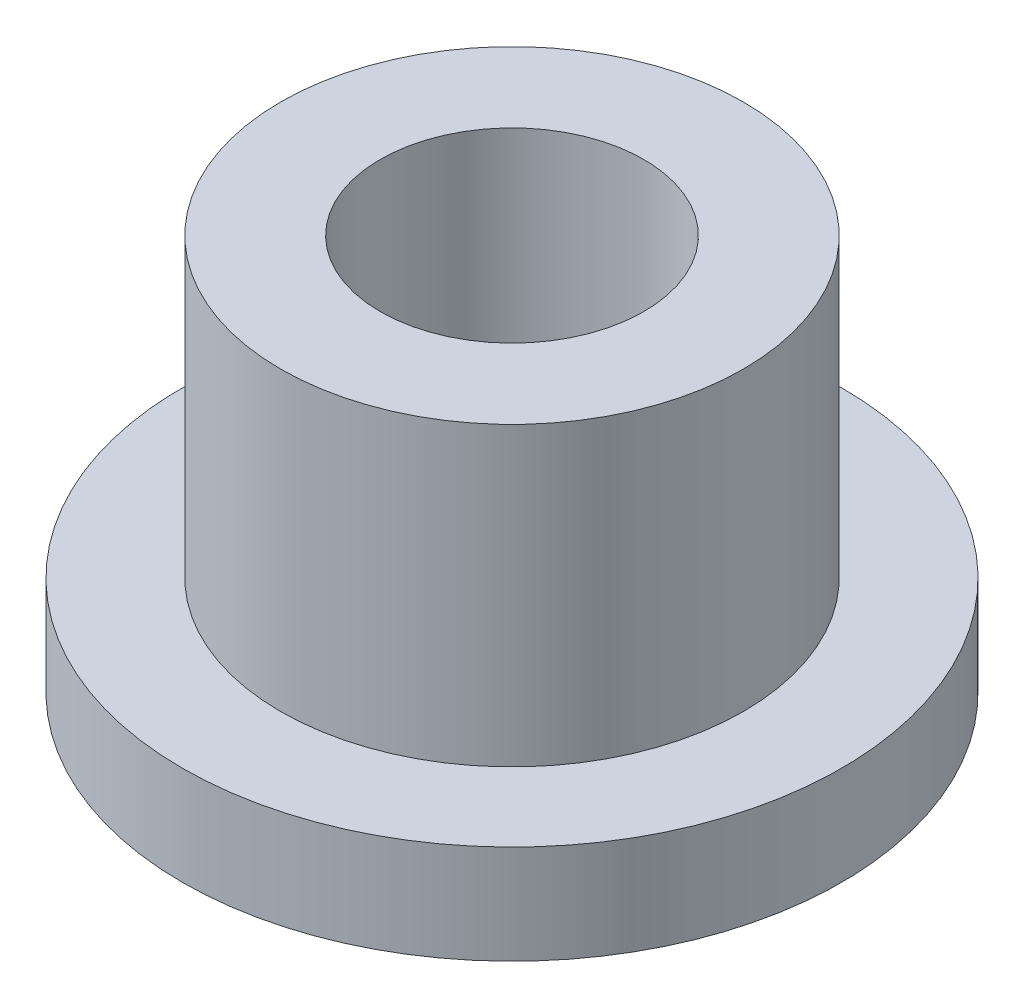
ISO-10303-21;
HEADER;
FILE_DESCRIPTION(('STEP AP214'),'2;1');
FILE_NAME('part.step','',(''),(''),'','','');
FILE_SCHEMA(('AUTOMOTIVE_DESIGN { 1 0 10303 214 1 1 1 1 }'));
ENDSEC;
DATA;
#1=APPLICATION_CONTEXT('core data for automotive mechanical design processes');
#2=APPLICATION_PROTOCOL_DEFINITION('international standard','automotive_design',2000,#1);
#3=PRODUCT_CONTEXT('',#1,'mechanical');
#4=PRODUCT('Part','Part','',(#3));
#5=PRODUCT_RELATED_PRODUCT_CATEGORY('part','',(#4));
#6=PRODUCT_DEFINITION_FORMATION('','',#4);
#7=PRODUCT_DEFINITION_CONTEXT('part definition',#1,'design');
#8=PRODUCT_DEFINITION('design','',#6,#7);
#9=PRODUCT_DEFINITION_SHAPE('','',#8);
#10=(LENGTH_UNIT() NAMED_UNIT(*) SI_UNIT(.MILLI.,.METRE.));
#11=(NAMED_UNIT(*) PLANE_ANGLE_UNIT() SI_UNIT($,.RADIAN.));
#12=(NAMED_UNIT(*) SI_UNIT($,.STERADIAN.) SOLID_ANGLE_UNIT());
#13=UNCERTAINTY_MEASURE_WITH_UNIT(LENGTH_MEASURE(1.E-05),#10,'distance_accuracy_value','');
#14=(GEOMETRIC_REPRESENTATION_CONTEXT(3) GLOBAL_UNCERTAINTY_ASSIGNED_CONTEXT((#13)) GLOBAL_UNIT_ASSIGNED_CONTEXT((#10,
#11,#12)) REPRESENTATION_CONTEXT('',''));
#15=CARTESIAN_POINT('',(0.,0.,0.));
#16=DIRECTION('',(0.,0.,1.));
#17=DIRECTION('',(1.,0.,0.));
#18=AXIS2_PLACEMENT_3D('',#15,#16,#17);
#19=CARTESIAN_POINT('',(0.,6.,0.));
#20=DIRECTION('',(0.,1.,0.));
#21=DIRECTION('',(0.,0.,1.));
#22=AXIS2_PLACEMENT_3D('',#19,#20,#21);
#23=PLANE('',#22);
#24=CARTESIAN_POINT('',(0.,6.,0.));
#25=DIRECTION('',(0.,1.,0.));
#26=DIRECTION('',(0.,0.,1.));
#27=AXIS2_PLACEMENT_3D('',#24,#25,#26);
#28=CIRCLE('',#27,3.51);
#29=CARTESIAN_POINT('',(0.,6.,3.51));
#30=VERTEX_POINT('',#29);
#31=EDGE_CURVE('E10',#30,#30,#28,.T.);
#32=ORIENTED_EDGE('',*,*,#31,.T.);
#33=EDGE_LOOP('',(#32));
#34=FACE_BOUND('',#33,.T.);
#35=CARTESIAN_POINT('',(0.,6.,0.));
#36=DIRECTION('',(0.,1.,0.));
#37=DIRECTION('',(0.,0.,1.));
#38=AXIS2_PLACEMENT_3D('',#35,#36,#37);
#39=CIRCLE('',#38,2.);
#40=CARTESIAN_POINT('',(0.,6.,2.));
#41=VERTEX_POINT('',#40);
#42=EDGE_CURVE('E39',#41,#41,#39,.T.);
#43=ORIENTED_EDGE('',*,*,#42,.F.);
#44=EDGE_LOOP('',(#43));
#45=FACE_BOUND('',#44,.T.);
#46=ADVANCED_FACE('F32',(#34,#45),#23,.T.);
#47=CARTESIAN_POINT('',(0.,0.,0.));
#48=DIRECTION('',(0.,1.,0.));
#49=DIRECTION('',(0.,0.,1.));
#50=AXIS2_PLACEMENT_3D('',#47,#48,#49);
#51=PLANE('',#50);
#52=CARTESIAN_POINT('',(0.,0.,0.));
#53=DIRECTION('',(0.,1.,0.));
#54=DIRECTION('',(0.,0.,1.));
#55=AXIS2_PLACEMENT_3D('',#52,#53,#54);
#56=CIRCLE('',#55,2.);
#57=CARTESIAN_POINT('',(0.,0.,2.));
#58=VERTEX_POINT('',#57);
#59=EDGE_CURVE('E43',#58,#58,#56,.T.);
#60=ORIENTED_EDGE('',*,*,#59,.T.);
#61=EDGE_LOOP('',(#60));
#62=FACE_BOUND('',#61,.T.);
#63=CARTESIAN_POINT('',(0.,0.,0.));
#64=DIRECTION('',(0.,1.,0.));
#65=DIRECTION('',(0.,0.,1.));
#66=AXIS2_PLACEMENT_3D('',#63,#64,#65);
#67=CIRCLE('',#66,5.);
#68=CARTESIAN_POINT('',(0.,0.,5.));
#69=VERTEX_POINT('',#68);
#70=EDGE_CURVE('E50',#69,#69,#67,.T.);
#71=ORIENTED_EDGE('',*,*,#70,.F.);
#72=EDGE_LOOP('',(#71));
#73=FACE_BOUND('',#72,.T.);
#74=ADVANCED_FACE('F75',(#62,#73),#51,.F.);
#75=CARTESIAN_POINT('',(0.,6.,0.));
#76=DIRECTION('',(0.,-1.,0.));
#77=DIRECTION('',(0.,0.,-1.));
#78=AXIS2_PLACEMENT_3D('',#75,#76,#77);
#79=CYLINDRICAL_SURFACE('',#78,3.51);
#80=CARTESIAN_POINT('',(0.,1.5,0.));
#81=DIRECTION('',(0.,1.,0.));
#82=DIRECTION('',(0.,0.,1.));
#83=AXIS2_PLACEMENT_3D('',#80,#81,#82);
#84=CIRCLE('',#83,3.51);
#85=CARTESIAN_POINT('',(0.,1.5,3.51));
#86=VERTEX_POINT('',#85);
#87=EDGE_CURVE('E53',#86,#86,#84,.T.);
#88=ORIENTED_EDGE('',*,*,#87,.T.);
#89=EDGE_LOOP('',(#88));
#90=FACE_BOUND('',#89,.T.);
#91=ORIENTED_EDGE('',*,*,#31,.F.);
#92=EDGE_LOOP('',(#91));
#93=FACE_BOUND('',#92,.T.);
#94=ADVANCED_FACE('F34',(#90,#93),#79,.T.);
#95=CARTESIAN_POINT('',(0.,6.,0.));
#96=DIRECTION('',(0.,-1.,0.));
#97=DIRECTION('',(0.,0.,-1.));
#98=AXIS2_PLACEMENT_3D('',#95,#96,#97);
#99=CYLINDRICAL_SURFACE('',#98,2.);
#100=ORIENTED_EDGE('',*,*,#42,.T.);
#101=EDGE_LOOP('',(#100));
#102=FACE_BOUND('',#101,.T.);
#103=ORIENTED_EDGE('',*,*,#59,.F.);
#104=EDGE_LOOP('',(#103));
#105=FACE_BOUND('',#104,.T.);
#106=ADVANCED_FACE('F64',(#102,#105),#99,.F.);
#107=CARTESIAN_POINT('',(0.,1.5,0.));
#108=DIRECTION('',(0.,1.,0.));
#109=DIRECTION('',(0.,0.,1.));
#110=AXIS2_PLACEMENT_3D('',#107,#108,#109);
#111=PLANE('',#110);
#112=CARTESIAN_POINT('',(0.,1.5,0.));
#113=DIRECTION('',(0.,1.,0.));
#114=DIRECTION('',(0.,0.,1.));
#115=AXIS2_PLACEMENT_3D('',#112,#113,#114);
#116=CIRCLE('',#115,5.);
#117=CARTESIAN_POINT('',(0.,1.5,5.));
#118=VERTEX_POINT('',#117);
#119=EDGE_CURVE('E48',#118,#118,#116,.T.);
#120=ORIENTED_EDGE('',*,*,#119,.T.);
#121=EDGE_LOOP('',(#120));
#122=FACE_BOUND('',#121,.T.);
#123=ORIENTED_EDGE('',*,*,#87,.F.);
#124=EDGE_LOOP('',(#123));
#125=FACE_BOUND('',#124,.T.);
#126=ADVANCED_FACE('F61',(#122,#125),#111,.T.);
#127=CARTESIAN_POINT('',(0.,1.5,0.));
#128=DIRECTION('',(0.,-1.,0.));
#129=DIRECTION('',(0.,0.,-1.));
#130=AXIS2_PLACEMENT_3D('',#127,#128,#129);
#131=CYLINDRICAL_SURFACE('',#130,5.);
#132=ORIENTED_EDGE('',*,*,#119,.F.);
#133=EDGE_LOOP('',(#132));
#134=FACE_BOUND('',#133,.T.);
#135=ORIENTED_EDGE('',*,*,#70,.T.);
#136=EDGE_LOOP('',(#135));
#137=FACE_BOUND('',#136,.T.);
#138=ADVANCED_FACE('F63',(#134,#137),#131,.T.);
#139=CLOSED_SHELL('',(#46,#74,#94,#106,#126,#138));
#140=MANIFOLD_SOLID_BREP('B2',#139);
#141=ADVANCED_BREP_SHAPE_REPRESENTATION('',(#18,#140),#14);
#142=SHAPE_DEFINITION_REPRESENTATION(#9,#141);
ENDSEC;
END-ISO-10303-21;
